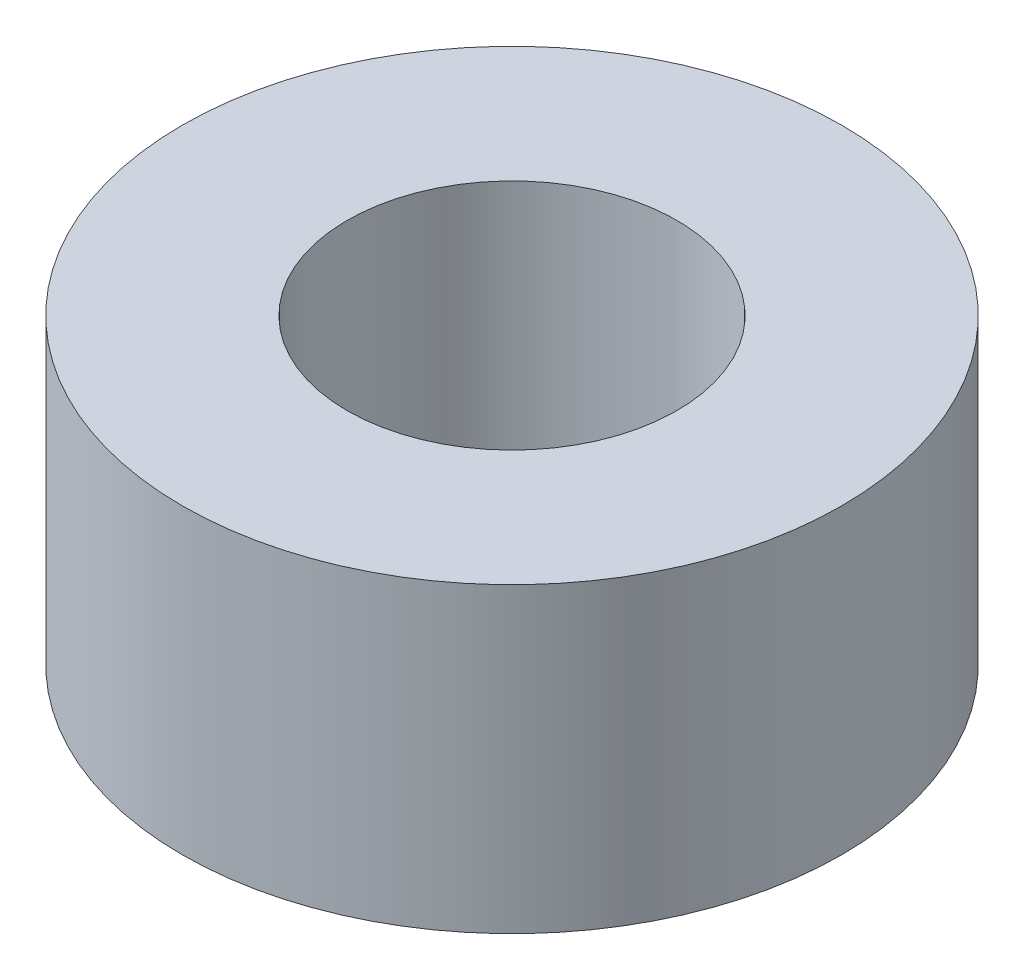
ISO-10303-21;
HEADER;
FILE_DESCRIPTION(('STEP AP214'),'2;1');
FILE_NAME('part.step','',(''),(''),'','','');
FILE_SCHEMA(('AUTOMOTIVE_DESIGN { 1 0 10303 214 1 1 1 1 }'));
ENDSEC;
DATA;
#1=APPLICATION_CONTEXT('core data for automotive mechanical design processes');
#2=APPLICATION_PROTOCOL_DEFINITION('international standard','automotive_design',2000,#1);
#3=PRODUCT_CONTEXT('',#1,'mechanical');
#4=PRODUCT('Part','Part','',(#3));
#5=PRODUCT_RELATED_PRODUCT_CATEGORY('part','',(#4));
#6=PRODUCT_DEFINITION_FORMATION('','',#4);
#7=PRODUCT_DEFINITION_CONTEXT('part definition',#1,'design');
#8=PRODUCT_DEFINITION('design','',#6,#7);
#9=PRODUCT_DEFINITION_SHAPE('','',#8);
#10=(LENGTH_UNIT() NAMED_UNIT(*) SI_UNIT(.MILLI.,.METRE.));
#11=(NAMED_UNIT(*) PLANE_ANGLE_UNIT() SI_UNIT($,.RADIAN.));
#12=(NAMED_UNIT(*) SI_UNIT($,.STERADIAN.) SOLID_ANGLE_UNIT());
#13=UNCERTAINTY_MEASURE_WITH_UNIT(LENGTH_MEASURE(1.E-05),#10,'distance_accuracy_value','');
#14=(GEOMETRIC_REPRESENTATION_CONTEXT(3) GLOBAL_UNCERTAINTY_ASSIGNED_CONTEXT((#13)) GLOBAL_UNIT_ASSIGNED_CONTEXT((#10,
#11,#12)) REPRESENTATION_CONTEXT('',''));
#15=CARTESIAN_POINT('',(0.,0.,0.));
#16=DIRECTION('',(0.,0.,1.));
#17=DIRECTION('',(1.,0.,0.));
#18=AXIS2_PLACEMENT_3D('',#15,#16,#17);
#19=CARTESIAN_POINT('',(0.,5.5,0.));
#20=DIRECTION('',(0.,1.,0.));
#21=DIRECTION('',(0.,0.,1.));
#22=AXIS2_PLACEMENT_3D('',#19,#20,#21);
#23=PLANE('',#22);
#24=CARTESIAN_POINT('',(0.,5.5,0.));
#25=DIRECTION('',(0.,1.,0.));
#26=DIRECTION('',(0.,0.,1.));
#27=AXIS2_PLACEMENT_3D('',#24,#25,#26);
#28=CIRCLE('',#27,6.);
#29=CARTESIAN_POINT('',(0.,5.5,6.));
#30=VERTEX_POINT('',#29);
#31=EDGE_CURVE('E11',#30,#30,#28,.T.);
#32=ORIENTED_EDGE('',*,*,#31,.T.);
#33=EDGE_LOOP('',(#32));
#34=FACE_BOUND('',#33,.T.);
#35=CARTESIAN_POINT('',(0.,5.5,0.));
#36=DIRECTION('',(0.,1.,0.));
#37=DIRECTION('',(0.,0.,1.));
#38=AXIS2_PLACEMENT_3D('',#35,#36,#37);
#39=CIRCLE('',#38,3.);
#40=CARTESIAN_POINT('',(0.,5.5,3.));
#41=VERTEX_POINT('',#40);
#42=EDGE_CURVE('E48',#41,#41,#39,.T.);
#43=ORIENTED_EDGE('',*,*,#42,.F.);
#44=EDGE_LOOP('',(#43));
#45=FACE_BOUND('',#44,.T.);
#46=ADVANCED_FACE('F37',(#34,#45),#23,.T.);
#47=CARTESIAN_POINT('',(0.,0.,0.));
#48=DIRECTION('',(0.,1.,0.));
#49=DIRECTION('',(0.,0.,1.));
#50=AXIS2_PLACEMENT_3D('',#47,#48,#49);
#51=PLANE('',#50);
#52=CARTESIAN_POINT('',(0.,0.,0.));
#53=DIRECTION('',(0.,1.,0.));
#54=DIRECTION('',(0.,0.,1.));
#55=AXIS2_PLACEMENT_3D('',#52,#53,#54);
#56=CIRCLE('',#55,6.);
#57=CARTESIAN_POINT('',(0.,0.,6.));
#58=VERTEX_POINT('',#57);
#59=EDGE_CURVE('E41',#58,#58,#56,.T.);
#60=ORIENTED_EDGE('',*,*,#59,.F.);
#61=EDGE_LOOP('',(#60));
#62=FACE_BOUND('',#61,.T.);
#63=CARTESIAN_POINT('',(0.,0.,0.));
#64=DIRECTION('',(0.,1.,0.));
#65=DIRECTION('',(0.,0.,1.));
#66=AXIS2_PLACEMENT_3D('',#63,#64,#65);
#67=CIRCLE('',#66,3.);
#68=CARTESIAN_POINT('',(0.,0.,3.));
#69=VERTEX_POINT('',#68);
#70=EDGE_CURVE('E50',#69,#69,#67,.T.);
#71=ORIENTED_EDGE('',*,*,#70,.T.);
#72=EDGE_LOOP('',(#71));
#73=FACE_BOUND('',#72,.T.);
#74=ADVANCED_FACE('F60',(#62,#73),#51,.F.);
#75=CARTESIAN_POINT('',(0.,5.5,0.));
#76=DIRECTION('',(0.,-1.,0.));
#77=DIRECTION('',(0.,0.,-1.));
#78=AXIS2_PLACEMENT_3D('',#75,#76,#77);
#79=CYLINDRICAL_SURFACE('',#78,6.);
#80=ORIENTED_EDGE('',*,*,#31,.F.);
#81=EDGE_LOOP('',(#80));
#82=FACE_BOUND('',#81,.T.);
#83=ORIENTED_EDGE('',*,*,#59,.T.);
#84=EDGE_LOOP('',(#83));
#85=FACE_BOUND('',#84,.T.);
#86=ADVANCED_FACE('F39',(#82,#85),#79,.T.);
#87=CARTESIAN_POINT('',(0.,5.5,0.));
#88=DIRECTION('',(0.,-1.,0.));
#89=DIRECTION('',(0.,0.,-1.));
#90=AXIS2_PLACEMENT_3D('',#87,#88,#89);
#91=CYLINDRICAL_SURFACE('',#90,3.);
#92=ORIENTED_EDGE('',*,*,#42,.T.);
#93=EDGE_LOOP('',(#92));
#94=FACE_BOUND('',#93,.T.);
#95=ORIENTED_EDGE('',*,*,#70,.F.);
#96=EDGE_LOOP('',(#95));
#97=FACE_BOUND('',#96,.T.);
#98=ADVANCED_FACE('F56',(#94,#97),#91,.F.);
#99=CLOSED_SHELL('',(#46,#74,#86,#98));
#100=MANIFOLD_SOLID_BREP('B2',#99);
#101=ADVANCED_BREP_SHAPE_REPRESENTATION('',(#18,#100),#14);
#102=SHAPE_DEFINITION_REPRESENTATION(#9,#101);
ENDSEC;
END-ISO-10303-21;
